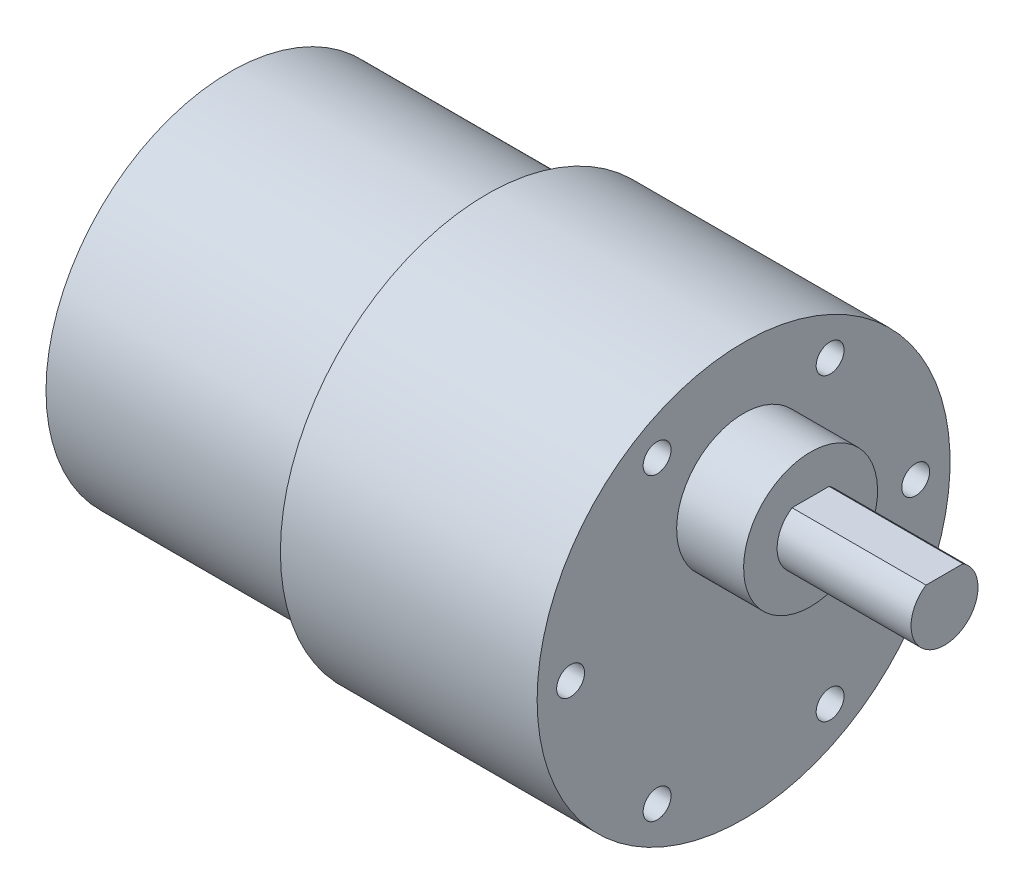
ISO-10303-21;
HEADER;
FILE_DESCRIPTION(('STEP AP214'),'2;1');
FILE_NAME('part.step','',(''),(''),'','','');
FILE_SCHEMA(('AUTOMOTIVE_DESIGN { 1 0 10303 214 1 1 1 1 }'));
ENDSEC;
DATA;
#1=APPLICATION_CONTEXT('core data for automotive mechanical design processes');
#2=APPLICATION_PROTOCOL_DEFINITION('international standard','automotive_design',2000,#1);
#3=PRODUCT_CONTEXT('',#1,'mechanical');
#4=PRODUCT('Part','Part','',(#3));
#5=PRODUCT_RELATED_PRODUCT_CATEGORY('part','',(#4));
#6=PRODUCT_DEFINITION_FORMATION('','',#4);
#7=PRODUCT_DEFINITION_CONTEXT('part definition',#1,'design');
#8=PRODUCT_DEFINITION('design','',#6,#7);
#9=PRODUCT_DEFINITION_SHAPE('','',#8);
#10=(LENGTH_UNIT() NAMED_UNIT(*) SI_UNIT(.MILLI.,.METRE.));
#11=(NAMED_UNIT(*) PLANE_ANGLE_UNIT() SI_UNIT($,.RADIAN.));
#12=(NAMED_UNIT(*) SI_UNIT($,.STERADIAN.) SOLID_ANGLE_UNIT());
#13=UNCERTAINTY_MEASURE_WITH_UNIT(LENGTH_MEASURE(1.E-05),#10,'distance_accuracy_value','');
#14=(GEOMETRIC_REPRESENTATION_CONTEXT(3) GLOBAL_UNCERTAINTY_ASSIGNED_CONTEXT((#13)) GLOBAL_UNIT_ASSIGNED_CONTEXT((#10,
#11,#12)) REPRESENTATION_CONTEXT('',''));
#15=CARTESIAN_POINT('',(0.,0.,0.));
#16=DIRECTION('',(0.,0.,1.));
#17=DIRECTION('',(1.,0.,0.));
#18=AXIS2_PLACEMENT_3D('',#15,#16,#17);
#19=CARTESIAN_POINT('',(0.,16.5,0.));
#20=DIRECTION('',(1.,0.,0.));
#21=DIRECTION('',(0.,0.,-1.));
#22=AXIS2_PLACEMENT_3D('',#19,#20,#21);
#23=PLANE('',#22);
#24=CARTESIAN_POINT('',(0.,0.,0.));
#25=DIRECTION('',(-1.,0.,0.));
#26=DIRECTION('',(0.,0.,1.));
#27=AXIS2_PLACEMENT_3D('',#24,#25,#26);
#28=CIRCLE('',#27,16.5);
#29=CARTESIAN_POINT('',(0.,0.,16.5));
#30=VERTEX_POINT('',#29);
#31=EDGE_CURVE('E145',#30,#30,#28,.T.);
#32=ORIENTED_EDGE('',*,*,#31,.T.);
#33=EDGE_LOOP('',(#32));
#34=FACE_BOUND('',#33,.T.);
#35=ADVANCED_FACE('F39',(#34),#23,.F.);
#36=CARTESIAN_POINT('',(46.,0.,0.));
#37=DIRECTION('',(-1.,0.,0.));
#38=DIRECTION('',(0.,0.,1.));
#39=AXIS2_PLACEMENT_3D('',#36,#37,#38);
#40=PLANE('',#39);
#41=CARTESIAN_POINT('',(46.,13.4233937586588,7.75));
#42=DIRECTION('',(1.,0.,0.));
#43=DIRECTION('',(0.,0.,-1.));
#44=AXIS2_PLACEMENT_3D('',#41,#42,#43);
#45=CIRCLE('',#44,1.25);
#46=CARTESIAN_POINT('',(46.,13.4233937586588,6.5));
#47=VERTEX_POINT('',#46);
#48=EDGE_CURVE('E94',#47,#47,#45,.T.);
#49=ORIENTED_EDGE('',*,*,#48,.F.);
#50=EDGE_LOOP('',(#49));
#51=FACE_BOUND('',#50,.T.);
#52=CARTESIAN_POINT('',(46.,13.4233937586588,-7.75));
#53=DIRECTION('',(1.,0.,0.));
#54=DIRECTION('',(0.,0.,-1.));
#55=AXIS2_PLACEMENT_3D('',#52,#53,#54);
#56=CIRCLE('',#55,1.25);
#57=CARTESIAN_POINT('',(46.,13.4233937586588,-9.));
#58=VERTEX_POINT('',#57);
#59=EDGE_CURVE('E93',#58,#58,#56,.T.);
#60=ORIENTED_EDGE('',*,*,#59,.F.);
#61=EDGE_LOOP('',(#60));
#62=FACE_BOUND('',#61,.T.);
#63=CARTESIAN_POINT('',(46.,0.144607536169079,-15.4165108000659));
#64=DIRECTION('',(1.,0.,0.));
#65=DIRECTION('',(0.,0.,-1.));
#66=AXIS2_PLACEMENT_3D('',#63,#64,#65);
#67=CIRCLE('',#66,1.25);
#68=CARTESIAN_POINT('',(46.,0.144607536169079,-16.6665108000659));
#69=VERTEX_POINT('',#68);
#70=EDGE_CURVE('E104',#69,#69,#67,.T.);
#71=ORIENTED_EDGE('',*,*,#70,.F.);
#72=EDGE_LOOP('',(#71));
#73=FACE_BOUND('',#72,.T.);
#74=CARTESIAN_POINT('',(46.,-13.4233937586588,-7.75));
#75=DIRECTION('',(1.,0.,0.));
#76=DIRECTION('',(0.,0.,-1.));
#77=AXIS2_PLACEMENT_3D('',#74,#75,#76);
#78=CIRCLE('',#77,1.25);
#79=CARTESIAN_POINT('',(46.,-13.4233937586588,-9.));
#80=VERTEX_POINT('',#79);
#81=EDGE_CURVE('E110',#80,#80,#78,.T.);
#82=ORIENTED_EDGE('',*,*,#81,.F.);
#83=EDGE_LOOP('',(#82));
#84=FACE_BOUND('',#83,.T.);
#85=CARTESIAN_POINT('',(46.,-13.4233937586588,7.75));
#86=DIRECTION('',(1.,0.,0.));
#87=DIRECTION('',(0.,0.,-1.));
#88=AXIS2_PLACEMENT_3D('',#85,#86,#87);
#89=CIRCLE('',#88,1.25);
#90=CARTESIAN_POINT('',(46.,-13.4233937586588,6.5));
#91=VERTEX_POINT('',#90);
#92=EDGE_CURVE('E116',#91,#91,#89,.T.);
#93=ORIENTED_EDGE('',*,*,#92,.F.);
#94=EDGE_LOOP('',(#93));
#95=FACE_BOUND('',#94,.T.);
#96=CARTESIAN_POINT('',(46.,0.,15.5));
#97=DIRECTION('',(1.,0.,0.));
#98=DIRECTION('',(0.,0.,-1.));
#99=AXIS2_PLACEMENT_3D('',#96,#97,#98);
#100=CIRCLE('',#99,1.25);
#101=CARTESIAN_POINT('',(46.,0.,14.25));
#102=VERTEX_POINT('',#101);
#103=EDGE_CURVE('E122',#102,#102,#100,.T.);
#104=ORIENTED_EDGE('',*,*,#103,.F.);
#105=EDGE_LOOP('',(#104));
#106=FACE_BOUND('',#105,.T.);
#107=CARTESIAN_POINT('',(46.,7.,0.));
#108=DIRECTION('',(-1.,0.,0.));
#109=DIRECTION('',(0.,-1.,0.));
#110=AXIS2_PLACEMENT_3D('',#107,#108,#109);
#111=CIRCLE('',#110,6.);
#112=CARTESIAN_POINT('',(46.,0.999999999999999,0.));
#113=VERTEX_POINT('',#112);
#114=EDGE_CURVE('E134',#113,#113,#111,.T.);
#115=ORIENTED_EDGE('',*,*,#114,.T.);
#116=EDGE_LOOP('',(#115));
#117=FACE_BOUND('',#116,.T.);
#118=CARTESIAN_POINT('',(46.,0.,0.));
#119=DIRECTION('',(-1.,0.,0.));
#120=DIRECTION('',(0.,0.,1.));
#121=AXIS2_PLACEMENT_3D('',#118,#119,#120);
#122=CIRCLE('',#121,18.5);
#123=CARTESIAN_POINT('',(46.,0.,18.5));
#124=VERTEX_POINT('',#123);
#125=EDGE_CURVE('E11',#124,#124,#122,.T.);
#126=ORIENTED_EDGE('',*,*,#125,.F.);
#127=EDGE_LOOP('',(#126));
#128=FACE_BOUND('',#127,.T.);
#129=ADVANCED_FACE('F158',(#51,#62,#73,#84,#95,#106,#117,#128),#40,.F.);
#130=CARTESIAN_POINT('',(0.,0.,0.));
#131=DIRECTION('',(-1.,0.,0.));
#132=DIRECTION('',(0.,0.,1.));
#133=AXIS2_PLACEMENT_3D('',#130,#131,#132);
#134=CYLINDRICAL_SURFACE('',#133,18.5);
#135=CARTESIAN_POINT('',(23.,0.,0.));
#136=DIRECTION('',(-1.,0.,0.));
#137=DIRECTION('',(0.,0.,1.));
#138=AXIS2_PLACEMENT_3D('',#135,#136,#137);
#139=CIRCLE('',#138,18.5);
#140=CARTESIAN_POINT('',(23.,0.,18.5));
#141=VERTEX_POINT('',#140);
#142=EDGE_CURVE('E46',#141,#141,#139,.T.);
#143=ORIENTED_EDGE('',*,*,#142,.F.);
#144=EDGE_LOOP('',(#143));
#145=FACE_BOUND('',#144,.T.);
#146=ORIENTED_EDGE('',*,*,#125,.T.);
#147=EDGE_LOOP('',(#146));
#148=FACE_BOUND('',#147,.T.);
#149=ADVANCED_FACE('F155',(#145,#148),#134,.T.);
#150=CARTESIAN_POINT('',(23.,18.5,0.));
#151=DIRECTION('',(1.,0.,0.));
#152=DIRECTION('',(0.,0.,-1.));
#153=AXIS2_PLACEMENT_3D('',#150,#151,#152);
#154=PLANE('',#153);
#155=CARTESIAN_POINT('',(23.,0.,0.));
#156=DIRECTION('',(-1.,0.,0.));
#157=DIRECTION('',(0.,0.,1.));
#158=AXIS2_PLACEMENT_3D('',#155,#156,#157);
#159=CIRCLE('',#158,16.5);
#160=CARTESIAN_POINT('',(23.,0.,16.5));
#161=VERTEX_POINT('',#160);
#162=EDGE_CURVE('E148',#161,#161,#159,.T.);
#163=ORIENTED_EDGE('',*,*,#162,.F.);
#164=EDGE_LOOP('',(#163));
#165=FACE_BOUND('',#164,.T.);
#166=ORIENTED_EDGE('',*,*,#142,.T.);
#167=EDGE_LOOP('',(#166));
#168=FACE_BOUND('',#167,.T.);
#169=ADVANCED_FACE('F153',(#165,#168),#154,.F.);
#170=CARTESIAN_POINT('',(0.,0.,0.));
#171=DIRECTION('',(-1.,0.,0.));
#172=DIRECTION('',(0.,0.,1.));
#173=AXIS2_PLACEMENT_3D('',#170,#171,#172);
#174=CYLINDRICAL_SURFACE('',#173,16.5);
#175=ORIENTED_EDGE('',*,*,#31,.F.);
#176=EDGE_LOOP('',(#175));
#177=FACE_BOUND('',#176,.T.);
#178=ORIENTED_EDGE('',*,*,#162,.T.);
#179=EDGE_LOOP('',(#178));
#180=FACE_BOUND('',#179,.T.);
#181=ADVANCED_FACE('F173',(#177,#180),#174,.T.);
#182=CARTESIAN_POINT('',(64.,7.,0.));
#183=DIRECTION('',(1.,0.,0.));
#184=DIRECTION('',(0.,1.,0.));
#185=AXIS2_PLACEMENT_3D('',#182,#183,#184);
#186=PLANE('',#185);
#187=DIRECTION('',(0.,0.,-1.));
#188=VECTOR('',#187,1.);
#189=CARTESIAN_POINT('',(64.,9.5,6.19878658436961));
#190=LINE('',#189,#188);
#191=CARTESIAN_POINT('',(64.,9.5,1.6583123951777));
#192=VERTEX_POINT('',#191);
#193=CARTESIAN_POINT('',(64.,9.5,-1.6583123951777));
#194=VERTEX_POINT('',#193);
#195=EDGE_CURVE('E59',#192,#194,#190,.T.);
#196=ORIENTED_EDGE('',*,*,#195,.F.);
#197=CARTESIAN_POINT('',(64.,7.,0.));
#198=DIRECTION('',(-1.,0.,0.));
#199=DIRECTION('',(0.,-1.,0.));
#200=AXIS2_PLACEMENT_3D('',#197,#198,#199);
#201=CIRCLE('',#200,3.);
#202=EDGE_CURVE('E142',#194,#192,#201,.T.);
#203=ORIENTED_EDGE('',*,*,#202,.F.);
#204=EDGE_LOOP('',(#196,#203));
#205=FACE_BOUND('',#204,.T.);
#206=ADVANCED_FACE('F177',(#205),#186,.T.);
#207=CARTESIAN_POINT('',(46.,7.,0.));
#208=DIRECTION('',(-1.,0.,0.));
#209=DIRECTION('',(0.,-1.,0.));
#210=AXIS2_PLACEMENT_3D('',#207,#208,#209);
#211=CYLINDRICAL_SURFACE('',#210,3.);
#212=DIRECTION('',(-1.,0.,0.));
#213=VECTOR('',#212,1.);
#214=CARTESIAN_POINT('',(46.,9.5,1.6583123951777));
#215=LINE('',#214,#213);
#216=CARTESIAN_POINT('',(52.,9.5,1.6583123951777));
#217=VERTEX_POINT('',#216);
#218=EDGE_CURVE('E132',#217,#192,#215,.F.);
#219=ORIENTED_EDGE('',*,*,#218,.F.);
#220=CARTESIAN_POINT('',(52.,7.,0.));
#221=DIRECTION('',(-1.,0.,0.));
#222=DIRECTION('',(0.,-1.,0.));
#223=AXIS2_PLACEMENT_3D('',#220,#221,#222);
#224=CIRCLE('',#223,3.);
#225=CARTESIAN_POINT('',(52.,9.5,-1.6583123951777));
#226=VERTEX_POINT('',#225);
#227=EDGE_CURVE('E140',#226,#217,#224,.T.);
#228=ORIENTED_EDGE('',*,*,#227,.F.);
#229=DIRECTION('',(-1.,0.,0.));
#230=VECTOR('',#229,1.);
#231=CARTESIAN_POINT('',(46.,9.5,-1.6583123951777));
#232=LINE('',#231,#230);
#233=EDGE_CURVE('E129',#194,#226,#232,.T.);
#234=ORIENTED_EDGE('',*,*,#233,.F.);
#235=ORIENTED_EDGE('',*,*,#202,.T.);
#236=EDGE_LOOP('',(#219,#228,#234,#235));
#237=FACE_BOUND('',#236,.T.);
#238=ADVANCED_FACE('F181',(#237),#211,.T.);
#239=CARTESIAN_POINT('',(52.,4.,0.));
#240=DIRECTION('',(1.,0.,0.));
#241=DIRECTION('',(0.,1.,0.));
#242=AXIS2_PLACEMENT_3D('',#239,#240,#241);
#243=PLANE('',#242);
#244=ORIENTED_EDGE('',*,*,#227,.T.);
#245=DIRECTION('',(0.,0.,1.));
#246=VECTOR('',#245,1.);
#247=CARTESIAN_POINT('',(52.,9.5,6.19878658436961));
#248=LINE('',#247,#246);
#249=EDGE_CURVE('E52',#226,#217,#248,.T.);
#250=ORIENTED_EDGE('',*,*,#249,.F.);
#251=EDGE_LOOP('',(#244,#250));
#252=FACE_BOUND('',#251,.T.);
#253=CARTESIAN_POINT('',(52.,7.,0.));
#254=DIRECTION('',(-1.,0.,0.));
#255=DIRECTION('',(0.,-1.,0.));
#256=AXIS2_PLACEMENT_3D('',#253,#254,#255);
#257=CIRCLE('',#256,6.);
#258=CARTESIAN_POINT('',(52.,1.,0.));
#259=VERTEX_POINT('',#258);
#260=EDGE_CURVE('E137',#259,#259,#257,.T.);
#261=ORIENTED_EDGE('',*,*,#260,.F.);
#262=EDGE_LOOP('',(#261));
#263=FACE_BOUND('',#262,.T.);
#264=ADVANCED_FACE('F185',(#252,#263),#243,.T.);
#265=CARTESIAN_POINT('',(46.,7.,0.));
#266=DIRECTION('',(-1.,0.,0.));
#267=DIRECTION('',(0.,-1.,0.));
#268=AXIS2_PLACEMENT_3D('',#265,#266,#267);
#269=CYLINDRICAL_SURFACE('',#268,6.);
#270=ORIENTED_EDGE('',*,*,#260,.T.);
#271=EDGE_LOOP('',(#270));
#272=FACE_BOUND('',#271,.T.);
#273=ORIENTED_EDGE('',*,*,#114,.F.);
#274=EDGE_LOOP('',(#273));
#275=FACE_BOUND('',#274,.T.);
#276=ADVANCED_FACE('F189',(#272,#275),#269,.T.);
#277=CARTESIAN_POINT('',(40.3079017406384,9.5,6.19878658436961));
#278=DIRECTION('',(0.,-1.,0.));
#279=DIRECTION('',(1.,0.,0.));
#280=AXIS2_PLACEMENT_3D('',#277,#278,#279);
#281=PLANE('',#280);
#282=ORIENTED_EDGE('',*,*,#218,.T.);
#283=ORIENTED_EDGE('',*,*,#195,.T.);
#284=ORIENTED_EDGE('',*,*,#233,.T.);
#285=ORIENTED_EDGE('',*,*,#249,.T.);
#286=EDGE_LOOP('',(#282,#283,#284,#285));
#287=FACE_BOUND('',#286,.T.);
#288=ADVANCED_FACE('F192',(#287),#281,.F.);
#289=CARTESIAN_POINT('',(38.5,0.,15.5));
#290=DIRECTION('',(1.,0.,0.));
#291=DIRECTION('',(0.,0.,-1.));
#292=AXIS2_PLACEMENT_3D('',#289,#290,#291);
#293=CONICAL_SURFACE('',#292,1.25,1.02974425867665);
#294=CARTESIAN_POINT('',(37.7489242262155,0.,15.5));
#295=VERTEX_POINT('',#294);
#296=VERTEX_LOOP('',#295);
#297=FACE_BOUND('',#296,.T.);
#298=CARTESIAN_POINT('',(38.5,0.,15.5));
#299=DIRECTION('',(1.,0.,0.));
#300=DIRECTION('',(0.,0.,-1.));
#301=AXIS2_PLACEMENT_3D('',#298,#299,#300);
#302=CIRCLE('',#301,1.25);
#303=CARTESIAN_POINT('',(38.5,0.,14.25));
#304=VERTEX_POINT('',#303);
#305=EDGE_CURVE('E125',#304,#304,#302,.T.);
#306=ORIENTED_EDGE('',*,*,#305,.T.);
#307=EDGE_LOOP('',(#306));
#308=FACE_BOUND('',#307,.T.);
#309=ADVANCED_FACE('F196',(#297,#308),#293,.F.);
#310=CARTESIAN_POINT('',(46.,0.,15.5));
#311=DIRECTION('',(1.,0.,0.));
#312=DIRECTION('',(0.,0.,-1.));
#313=AXIS2_PLACEMENT_3D('',#310,#311,#312);
#314=CYLINDRICAL_SURFACE('',#313,1.25);
#315=ORIENTED_EDGE('',*,*,#305,.F.);
#316=EDGE_LOOP('',(#315));
#317=FACE_BOUND('',#316,.T.);
#318=ORIENTED_EDGE('',*,*,#103,.T.);
#319=EDGE_LOOP('',(#318));
#320=FACE_BOUND('',#319,.T.);
#321=ADVANCED_FACE('F199',(#317,#320),#314,.F.);
#322=CARTESIAN_POINT('',(38.5,-13.4233937586588,7.75));
#323=DIRECTION('',(1.,0.,0.));
#324=DIRECTION('',(0.,0.,-1.));
#325=AXIS2_PLACEMENT_3D('',#322,#323,#324);
#326=CONICAL_SURFACE('',#325,1.25,1.02974425867665);
#327=CARTESIAN_POINT('',(37.7489242262155,-13.4233937586588,7.75));
#328=VERTEX_POINT('',#327);
#329=VERTEX_LOOP('',#328);
#330=FACE_BOUND('',#329,.T.);
#331=CARTESIAN_POINT('',(38.5,-13.4233937586588,7.75));
#332=DIRECTION('',(1.,0.,0.));
#333=DIRECTION('',(0.,0.,-1.));
#334=AXIS2_PLACEMENT_3D('',#331,#332,#333);
#335=CIRCLE('',#334,1.25);
#336=CARTESIAN_POINT('',(38.5,-13.4233937586588,6.5));
#337=VERTEX_POINT('',#336);
#338=EDGE_CURVE('E119',#337,#337,#335,.T.);
#339=ORIENTED_EDGE('',*,*,#338,.T.);
#340=EDGE_LOOP('',(#339));
#341=FACE_BOUND('',#340,.T.);
#342=ADVANCED_FACE('F203',(#330,#341),#326,.F.);
#343=CARTESIAN_POINT('',(46.,-13.4233937586588,7.75));
#344=DIRECTION('',(1.,0.,0.));
#345=DIRECTION('',(0.,0.,-1.));
#346=AXIS2_PLACEMENT_3D('',#343,#344,#345);
#347=CYLINDRICAL_SURFACE('',#346,1.25);
#348=ORIENTED_EDGE('',*,*,#338,.F.);
#349=EDGE_LOOP('',(#348));
#350=FACE_BOUND('',#349,.T.);
#351=ORIENTED_EDGE('',*,*,#92,.T.);
#352=EDGE_LOOP('',(#351));
#353=FACE_BOUND('',#352,.T.);
#354=ADVANCED_FACE('F207',(#350,#353),#347,.F.);
#355=CARTESIAN_POINT('',(38.5,-13.4233937586588,-7.75));
#356=DIRECTION('',(1.,0.,0.));
#357=DIRECTION('',(0.,0.,-1.));
#358=AXIS2_PLACEMENT_3D('',#355,#356,#357);
#359=CONICAL_SURFACE('',#358,1.25,1.02974425867665);
#360=CARTESIAN_POINT('',(37.7489242262155,-13.4233937586588,-7.75));
#361=VERTEX_POINT('',#360);
#362=VERTEX_LOOP('',#361);
#363=FACE_BOUND('',#362,.T.);
#364=CARTESIAN_POINT('',(38.5,-13.4233937586588,-7.75));
#365=DIRECTION('',(1.,0.,0.));
#366=DIRECTION('',(0.,0.,-1.));
#367=AXIS2_PLACEMENT_3D('',#364,#365,#366);
#368=CIRCLE('',#367,1.25);
#369=CARTESIAN_POINT('',(38.5,-13.4233937586588,-9.));
#370=VERTEX_POINT('',#369);
#371=EDGE_CURVE('E113',#370,#370,#368,.T.);
#372=ORIENTED_EDGE('',*,*,#371,.T.);
#373=EDGE_LOOP('',(#372));
#374=FACE_BOUND('',#373,.T.);
#375=ADVANCED_FACE('F211',(#363,#374),#359,.F.);
#376=CARTESIAN_POINT('',(46.,-13.4233937586588,-7.75));
#377=DIRECTION('',(1.,0.,0.));
#378=DIRECTION('',(0.,0.,-1.));
#379=AXIS2_PLACEMENT_3D('',#376,#377,#378);
#380=CYLINDRICAL_SURFACE('',#379,1.25);
#381=ORIENTED_EDGE('',*,*,#371,.F.);
#382=EDGE_LOOP('',(#381));
#383=FACE_BOUND('',#382,.T.);
#384=ORIENTED_EDGE('',*,*,#81,.T.);
#385=EDGE_LOOP('',(#384));
#386=FACE_BOUND('',#385,.T.);
#387=ADVANCED_FACE('F215',(#383,#386),#380,.F.);
#388=CARTESIAN_POINT('',(38.5,0.144607536169079,-15.4165108000659));
#389=DIRECTION('',(1.,0.,0.));
#390=DIRECTION('',(0.,0.,-1.));
#391=AXIS2_PLACEMENT_3D('',#388,#389,#390);
#392=CONICAL_SURFACE('',#391,1.25,1.02974425867665);
#393=CARTESIAN_POINT('',(37.7489242262155,0.144607536169077,-15.4165108000659));
#394=VERTEX_POINT('',#393);
#395=VERTEX_LOOP('',#394);
#396=FACE_BOUND('',#395,.T.);
#397=CARTESIAN_POINT('',(38.5,0.144607536169079,-15.4165108000659));
#398=DIRECTION('',(1.,0.,0.));
#399=DIRECTION('',(0.,0.,-1.));
#400=AXIS2_PLACEMENT_3D('',#397,#398,#399);
#401=CIRCLE('',#400,1.25);
#402=CARTESIAN_POINT('',(38.5,0.144607536169079,-16.6665108000659));
#403=VERTEX_POINT('',#402);
#404=EDGE_CURVE('E107',#403,#403,#401,.T.);
#405=ORIENTED_EDGE('',*,*,#404,.T.);
#406=EDGE_LOOP('',(#405));
#407=FACE_BOUND('',#406,.T.);
#408=ADVANCED_FACE('F219',(#396,#407),#392,.F.);
#409=CARTESIAN_POINT('',(46.,0.144607536169079,-15.4165108000659));
#410=DIRECTION('',(1.,0.,0.));
#411=DIRECTION('',(0.,0.,-1.));
#412=AXIS2_PLACEMENT_3D('',#409,#410,#411);
#413=CYLINDRICAL_SURFACE('',#412,1.25);
#414=ORIENTED_EDGE('',*,*,#404,.F.);
#415=EDGE_LOOP('',(#414));
#416=FACE_BOUND('',#415,.T.);
#417=ORIENTED_EDGE('',*,*,#70,.T.);
#418=EDGE_LOOP('',(#417));
#419=FACE_BOUND('',#418,.T.);
#420=ADVANCED_FACE('F223',(#416,#419),#413,.F.);
#421=CARTESIAN_POINT('',(38.5,13.4233937586588,-7.75));
#422=DIRECTION('',(1.,0.,0.));
#423=DIRECTION('',(0.,0.,-1.));
#424=AXIS2_PLACEMENT_3D('',#421,#422,#423);
#425=CONICAL_SURFACE('',#424,1.25,1.02974425867665);
#426=CARTESIAN_POINT('',(37.7489242262155,13.4233937586588,-7.75));
#427=VERTEX_POINT('',#426);
#428=VERTEX_LOOP('',#427);
#429=FACE_BOUND('',#428,.T.);
#430=CARTESIAN_POINT('',(38.5,13.4233937586588,-7.75));
#431=DIRECTION('',(1.,0.,0.));
#432=DIRECTION('',(0.,0.,-1.));
#433=AXIS2_PLACEMENT_3D('',#430,#431,#432);
#434=CIRCLE('',#433,1.25);
#435=CARTESIAN_POINT('',(38.5,13.4233937586588,-9.));
#436=VERTEX_POINT('',#435);
#437=EDGE_CURVE('E97',#436,#436,#434,.T.);
#438=ORIENTED_EDGE('',*,*,#437,.T.);
#439=EDGE_LOOP('',(#438));
#440=FACE_BOUND('',#439,.T.);
#441=ADVANCED_FACE('F227',(#429,#440),#425,.F.);
#442=CARTESIAN_POINT('',(46.,13.4233937586588,-7.75));
#443=DIRECTION('',(1.,0.,0.));
#444=DIRECTION('',(0.,0.,-1.));
#445=AXIS2_PLACEMENT_3D('',#442,#443,#444);
#446=CYLINDRICAL_SURFACE('',#445,1.25);
#447=ORIENTED_EDGE('',*,*,#437,.F.);
#448=EDGE_LOOP('',(#447));
#449=FACE_BOUND('',#448,.T.);
#450=ORIENTED_EDGE('',*,*,#59,.T.);
#451=EDGE_LOOP('',(#450));
#452=FACE_BOUND('',#451,.T.);
#453=ADVANCED_FACE('F87',(#449,#452),#446,.F.);
#454=CARTESIAN_POINT('',(38.5,13.4233937586588,7.75));
#455=DIRECTION('',(1.,0.,0.));
#456=DIRECTION('',(0.,0.,-1.));
#457=AXIS2_PLACEMENT_3D('',#454,#455,#456);
#458=CONICAL_SURFACE('',#457,1.25,1.02974425867665);
#459=CARTESIAN_POINT('',(37.7489242262155,13.4233937586588,7.75));
#460=VERTEX_POINT('',#459);
#461=VERTEX_LOOP('',#460);
#462=FACE_BOUND('',#461,.T.);
#463=CARTESIAN_POINT('',(38.5,13.4233937586588,7.75));
#464=DIRECTION('',(1.,0.,0.));
#465=DIRECTION('',(0.,0.,-1.));
#466=AXIS2_PLACEMENT_3D('',#463,#464,#465);
#467=CIRCLE('',#466,1.25);
#468=CARTESIAN_POINT('',(38.5,13.4233937586588,6.5));
#469=VERTEX_POINT('',#468);
#470=EDGE_CURVE('E91',#469,#469,#467,.T.);
#471=ORIENTED_EDGE('',*,*,#470,.T.);
#472=EDGE_LOOP('',(#471));
#473=FACE_BOUND('',#472,.T.);
#474=ADVANCED_FACE('F83',(#462,#473),#458,.F.);
#475=CARTESIAN_POINT('',(46.,13.4233937586588,7.75));
#476=DIRECTION('',(1.,0.,0.));
#477=DIRECTION('',(0.,0.,-1.));
#478=AXIS2_PLACEMENT_3D('',#475,#476,#477);
#479=CYLINDRICAL_SURFACE('',#478,1.25);
#480=ORIENTED_EDGE('',*,*,#470,.F.);
#481=EDGE_LOOP('',(#480));
#482=FACE_BOUND('',#481,.T.);
#483=ORIENTED_EDGE('',*,*,#48,.T.);
#484=EDGE_LOOP('',(#483));
#485=FACE_BOUND('',#484,.T.);
#486=ADVANCED_FACE('F86',(#482,#485),#479,.F.);
#487=CLOSED_SHELL('',(#35,#129,#149,#169,#181,#206,#238,#264,#276,#288,#309,#321,#342,#354,#375,
#387,#408,#420,#441,#453,#474,#486));
#488=MANIFOLD_SOLID_BREP('B2',#487);
#489=ADVANCED_BREP_SHAPE_REPRESENTATION('',(#18,#488),#14);
#490=SHAPE_DEFINITION_REPRESENTATION(#9,#489);
ENDSEC;
END-ISO-10303-21;
